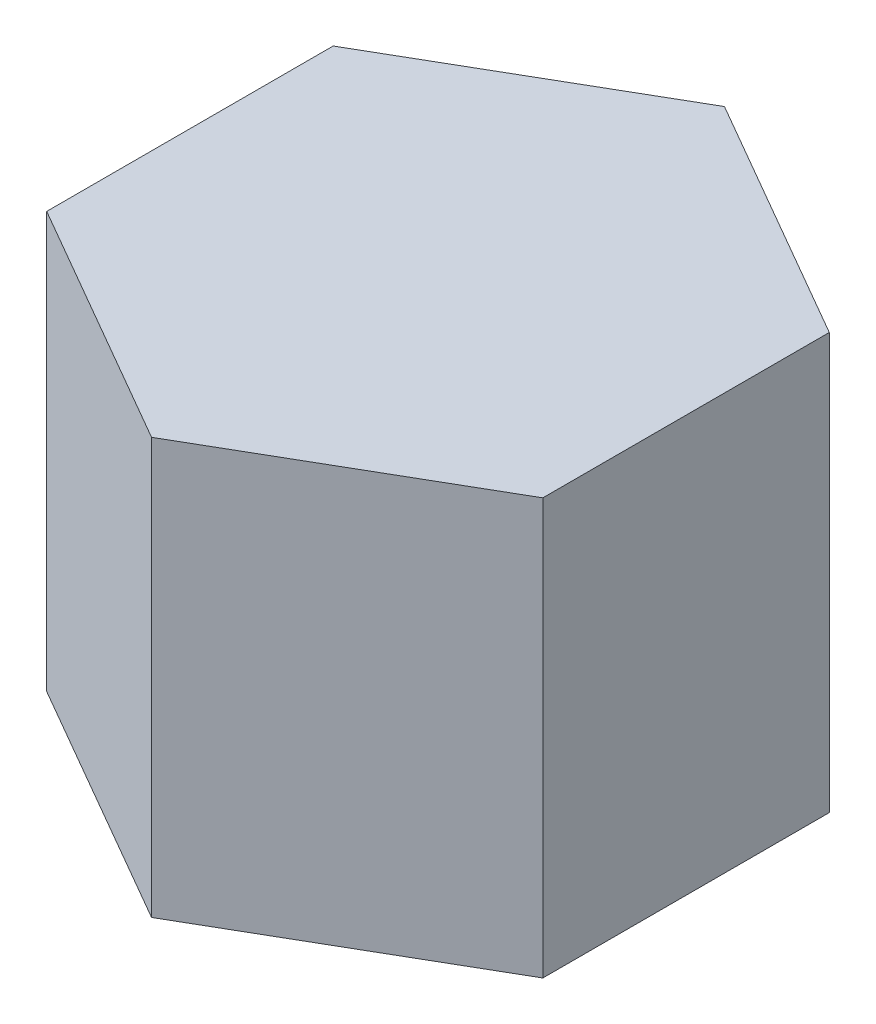
ISO-10303-21;
HEADER;
FILE_DESCRIPTION(('STEP AP214'),'2;1');
FILE_NAME('part.step','',(''),(''),'','','');
FILE_SCHEMA(('AUTOMOTIVE_DESIGN { 1 0 10303 214 1 1 1 1 }'));
ENDSEC;
DATA;
#1=APPLICATION_CONTEXT('core data for automotive mechanical design processes');
#2=APPLICATION_PROTOCOL_DEFINITION('international standard','automotive_design',2000,#1);
#3=PRODUCT_CONTEXT('',#1,'mechanical');
#4=PRODUCT('Part','Part','',(#3));
#5=PRODUCT_RELATED_PRODUCT_CATEGORY('part','',(#4));
#6=PRODUCT_DEFINITION_FORMATION('','',#4);
#7=PRODUCT_DEFINITION_CONTEXT('part definition',#1,'design');
#8=PRODUCT_DEFINITION('design','',#6,#7);
#9=PRODUCT_DEFINITION_SHAPE('','',#8);
#10=(LENGTH_UNIT() NAMED_UNIT(*) SI_UNIT(.MILLI.,.METRE.));
#11=(NAMED_UNIT(*) PLANE_ANGLE_UNIT() SI_UNIT($,.RADIAN.));
#12=(NAMED_UNIT(*) SI_UNIT($,.STERADIAN.) SOLID_ANGLE_UNIT());
#13=UNCERTAINTY_MEASURE_WITH_UNIT(LENGTH_MEASURE(1.E-05),#10,'distance_accuracy_value','');
#14=(GEOMETRIC_REPRESENTATION_CONTEXT(3) GLOBAL_UNCERTAINTY_ASSIGNED_CONTEXT((#13)) GLOBAL_UNIT_ASSIGNED_CONTEXT((#10,
#11,#12)) REPRESENTATION_CONTEXT('',''));
#15=CARTESIAN_POINT('',(0.,0.,0.));
#16=DIRECTION('',(0.,0.,1.));
#17=DIRECTION('',(1.,0.,0.));
#18=AXIS2_PLACEMENT_3D('',#15,#16,#17);
#19=CARTESIAN_POINT('',(207.642660308706,-148.537700895744,291.506971220494));
#20=DIRECTION('',(-0.499999999999909,0.,-0.866025403784491));
#21=DIRECTION('',(-0.866025403784491,0.,0.499999999999909));
#22=AXIS2_PLACEMENT_3D('',#19,#20,#21);
#23=PLANE('',#22);
#24=CARTESIAN_POINT('',(207.339551417382,-149.045793579175,291.681971220494));
#25=DIRECTION('',(0.866025403784491,0.,-0.499999999999909));
#26=VECTOR('',#25,1.);
#27=LINE('',#24,#26);
#28=CARTESIAN_POINT('',(207.339551417382,-149.045793579175,291.681971220494));
#29=VERTEX_POINT('',#28);
#30=CARTESIAN_POINT('',(207.642660308706,-149.045793579175,291.506971220494));
#31=VERTEX_POINT('',#30);
#32=EDGE_CURVE('E170',#29,#31,#27,.T.);
#33=ORIENTED_EDGE('',*,*,#32,.T.);
#34=CARTESIAN_POINT('',(207.642660308706,-148.537700895744,291.506971220494));
#35=DIRECTION('',(0.,-1.,0.));
#36=VECTOR('',#35,1.);
#37=LINE('',#34,#36);
#38=CARTESIAN_POINT('',(207.642660308706,-148.537700895744,291.506971220494));
#39=VERTEX_POINT('',#38);
#40=EDGE_CURVE('E35',#39,#31,#37,.T.);
#41=ORIENTED_EDGE('',*,*,#40,.F.);
#42=CARTESIAN_POINT('',(207.339551417382,-148.537700895744,291.681971220494));
#43=DIRECTION('',(0.866025403784491,0.,-0.499999999999909));
#44=VECTOR('',#43,1.);
#45=LINE('',#42,#44);
#46=CARTESIAN_POINT('',(207.339551417382,-148.537700895744,291.681971220494));
#47=VERTEX_POINT('',#46);
#48=EDGE_CURVE('E159',#47,#39,#45,.T.);
#49=ORIENTED_EDGE('',*,*,#48,.F.);
#50=CARTESIAN_POINT('',(207.339551417382,-148.537700895744,291.681971220494));
#51=DIRECTION('',(0.,-1.,0.));
#52=VECTOR('',#51,1.);
#53=LINE('',#50,#52);
#54=EDGE_CURVE('E10',#47,#29,#53,.T.);
#55=ORIENTED_EDGE('',*,*,#54,.T.);
#56=EDGE_LOOP('',(#33,#41,#49,#55));
#57=FACE_BOUND('',#56,.T.);
#58=ADVANCED_FACE('F16',(#57),#23,.F.);
#59=CARTESIAN_POINT('',(207.339551417382,-148.537700895744,291.681971220494));
#60=DIRECTION('',(0.500000000000062,0.,-0.866025403784403));
#61=DIRECTION('',(-0.866025403784403,0.,-0.500000000000062));
#62=AXIS2_PLACEMENT_3D('',#59,#60,#61);
#63=PLANE('',#62);
#64=CARTESIAN_POINT('',(207.036442526057,-149.045793579175,291.506971220494));
#65=DIRECTION('',(0.866025403784403,0.,0.500000000000062));
#66=VECTOR('',#65,1.);
#67=LINE('',#64,#66);
#68=CARTESIAN_POINT('',(207.036442526057,-149.045793579175,291.506971220494));
#69=VERTEX_POINT('',#68);
#70=EDGE_CURVE('E167',#69,#29,#67,.T.);
#71=ORIENTED_EDGE('',*,*,#70,.T.);
#72=ORIENTED_EDGE('',*,*,#54,.F.);
#73=CARTESIAN_POINT('',(207.036442526057,-148.537700895744,291.506971220494));
#74=DIRECTION('',(0.866025403784403,0.,0.500000000000062));
#75=VECTOR('',#74,1.);
#76=LINE('',#73,#75);
#77=CARTESIAN_POINT('',(207.036442526057,-148.537700895744,291.506971220494));
#78=VERTEX_POINT('',#77);
#79=EDGE_CURVE('E156',#78,#47,#76,.T.);
#80=ORIENTED_EDGE('',*,*,#79,.F.);
#81=CARTESIAN_POINT('',(207.036442526057,-148.537700895744,291.506971220494));
#82=DIRECTION('',(0.,-1.,0.));
#83=VECTOR('',#82,1.);
#84=LINE('',#81,#83);
#85=EDGE_CURVE('E27',#78,#69,#84,.T.);
#86=ORIENTED_EDGE('',*,*,#85,.T.);
#87=EDGE_LOOP('',(#71,#72,#80,#86));
#88=FACE_BOUND('',#87,.T.);
#89=ADVANCED_FACE('F189',(#88),#63,.F.);
#90=CARTESIAN_POINT('',(207.036442526057,-148.537700895744,290.831971220494));
#91=DIRECTION('',(1.,0.,0.));
#92=DIRECTION('',(0.,1.,0.));
#93=AXIS2_PLACEMENT_3D('',#90,#91,#92);
#94=PLANE('',#93);
#95=CARTESIAN_POINT('',(207.036442526057,-149.045793579175,291.156971220494));
#96=DIRECTION('',(0.,0.,1.));
#97=VECTOR('',#96,1.);
#98=LINE('',#95,#97);
#99=CARTESIAN_POINT('',(207.036442526057,-149.045793579175,291.156971220494));
#100=VERTEX_POINT('',#99);
#101=EDGE_CURVE('E163',#100,#69,#98,.T.);
#102=ORIENTED_EDGE('',*,*,#101,.T.);
#103=ORIENTED_EDGE('',*,*,#85,.F.);
#104=CARTESIAN_POINT('',(207.036442526057,-148.537700895744,291.156971220494));
#105=DIRECTION('',(0.,0.,1.));
#106=VECTOR('',#105,1.);
#107=LINE('',#104,#106);
#108=CARTESIAN_POINT('',(207.036442526057,-148.537700895744,291.156971220494));
#109=VERTEX_POINT('',#108);
#110=EDGE_CURVE('E106',#109,#78,#107,.T.);
#111=ORIENTED_EDGE('',*,*,#110,.F.);
#112=CARTESIAN_POINT('',(207.036442526057,-148.537700895744,291.156971220494));
#113=DIRECTION('',(0.,-1.,0.));
#114=VECTOR('',#113,1.);
#115=LINE('',#112,#114);
#116=EDGE_CURVE('E94',#109,#100,#115,.T.);
#117=ORIENTED_EDGE('',*,*,#116,.T.);
#118=EDGE_LOOP('',(#102,#103,#111,#117));
#119=FACE_BOUND('',#118,.T.);
#120=ADVANCED_FACE('F198',(#119),#94,.F.);
#121=CARTESIAN_POINT('',(207.036442526057,-148.537700895744,291.156971220494));
#122=DIRECTION('',(0.499999999999943,0.,0.866025403784472));
#123=DIRECTION('',(0.866025403784472,0.,-0.499999999999943));
#124=AXIS2_PLACEMENT_3D('',#121,#122,#123);
#125=PLANE('',#124);
#126=CARTESIAN_POINT('',(207.339551417382,-149.045793579175,290.981971220494));
#127=DIRECTION('',(-0.866025403784471,0.,0.499999999999943));
#128=VECTOR('',#127,1.);
#129=LINE('',#126,#128);
#130=CARTESIAN_POINT('',(207.339551417382,-149.045793579175,290.981971220494));
#131=VERTEX_POINT('',#130);
#132=EDGE_CURVE('E162',#131,#100,#129,.T.);
#133=ORIENTED_EDGE('',*,*,#132,.T.);
#134=ORIENTED_EDGE('',*,*,#116,.F.);
#135=CARTESIAN_POINT('',(207.339551417382,-148.537700895744,290.981971220494));
#136=DIRECTION('',(-0.866025403784471,0.,0.499999999999943));
#137=VECTOR('',#136,1.);
#138=LINE('',#135,#137);
#139=CARTESIAN_POINT('',(207.339551417382,-148.537700895744,290.981971220494));
#140=VERTEX_POINT('',#139);
#141=EDGE_CURVE('E98',#140,#109,#138,.T.);
#142=ORIENTED_EDGE('',*,*,#141,.F.);
#143=CARTESIAN_POINT('',(207.339551417382,-148.537700895744,290.981971220494));
#144=DIRECTION('',(0.,-1.,0.));
#145=VECTOR('',#144,1.);
#146=LINE('',#143,#145);
#147=EDGE_CURVE('E79',#140,#131,#146,.T.);
#148=ORIENTED_EDGE('',*,*,#147,.T.);
#149=EDGE_LOOP('',(#133,#134,#142,#148));
#150=FACE_BOUND('',#149,.T.);
#151=ADVANCED_FACE('F100',(#150),#125,.F.);
#152=CARTESIAN_POINT('',(207.339551417382,-148.537700895744,290.981971220494));
#153=DIRECTION('',(-0.500000000000062,0.,0.866025403784403));
#154=DIRECTION('',(0.866025403784403,0.,0.500000000000062));
#155=AXIS2_PLACEMENT_3D('',#152,#153,#154);
#156=PLANE('',#155);
#157=CARTESIAN_POINT('',(207.642660308706,-149.045793579175,291.156971220494));
#158=DIRECTION('',(-0.866025403784403,0.,-0.500000000000062));
#159=VECTOR('',#158,1.);
#160=LINE('',#157,#159);
#161=CARTESIAN_POINT('',(207.642660308706,-149.045793579175,291.156971220494));
#162=VERTEX_POINT('',#161);
#163=EDGE_CURVE('E88',#162,#131,#160,.T.);
#164=ORIENTED_EDGE('',*,*,#163,.T.);
#165=ORIENTED_EDGE('',*,*,#147,.F.);
#166=CARTESIAN_POINT('',(207.642660308706,-148.537700895744,291.156971220494));
#167=DIRECTION('',(-0.866025403784403,0.,-0.500000000000062));
#168=VECTOR('',#167,1.);
#169=LINE('',#166,#168);
#170=CARTESIAN_POINT('',(207.642660308706,-148.537700895744,291.156971220494));
#171=VERTEX_POINT('',#170);
#172=EDGE_CURVE('E84',#171,#140,#169,.T.);
#173=ORIENTED_EDGE('',*,*,#172,.F.);
#174=CARTESIAN_POINT('',(207.642660308706,-148.537700895744,291.156971220494));
#175=DIRECTION('',(0.,-1.,0.));
#176=VECTOR('',#175,1.);
#177=LINE('',#174,#176);
#178=EDGE_CURVE('E58',#171,#162,#177,.T.);
#179=ORIENTED_EDGE('',*,*,#178,.T.);
#180=EDGE_LOOP('',(#164,#165,#173,#179));
#181=FACE_BOUND('',#180,.T.);
#182=ADVANCED_FACE('F82',(#181),#156,.F.);
#183=CARTESIAN_POINT('',(207.642660308706,-148.537700895744,290.831971220494));
#184=DIRECTION('',(-1.,0.,0.));
#185=DIRECTION('',(0.,-1.,0.));
#186=AXIS2_PLACEMENT_3D('',#183,#184,#185);
#187=PLANE('',#186);
#188=CARTESIAN_POINT('',(207.642660308706,-149.045793579175,291.506971220494));
#189=DIRECTION('',(0.,0.,-1.));
#190=VECTOR('',#189,1.);
#191=LINE('',#188,#190);
#192=EDGE_CURVE('E160',#31,#162,#191,.T.);
#193=ORIENTED_EDGE('',*,*,#192,.T.);
#194=ORIENTED_EDGE('',*,*,#178,.F.);
#195=CARTESIAN_POINT('',(207.642660308706,-148.537700895744,291.506971220494));
#196=DIRECTION('',(0.,0.,-1.));
#197=VECTOR('',#196,1.);
#198=LINE('',#195,#197);
#199=EDGE_CURVE('E112',#39,#171,#198,.T.);
#200=ORIENTED_EDGE('',*,*,#199,.F.);
#201=ORIENTED_EDGE('',*,*,#40,.T.);
#202=EDGE_LOOP('',(#193,#194,#200,#201));
#203=FACE_BOUND('',#202,.T.);
#204=ADVANCED_FACE('F131',(#203),#187,.F.);
#205=CARTESIAN_POINT('',(206.339551417382,-148.537700895744,290.831971220494));
#206=DIRECTION('',(0.,-1.,0.));
#207=DIRECTION('',(1.,0.,0.));
#208=AXIS2_PLACEMENT_3D('',#205,#206,#207);
#209=PLANE('',#208);
#210=ORIENTED_EDGE('',*,*,#48,.T.);
#211=ORIENTED_EDGE('',*,*,#199,.T.);
#212=ORIENTED_EDGE('',*,*,#172,.T.);
#213=ORIENTED_EDGE('',*,*,#141,.T.);
#214=ORIENTED_EDGE('',*,*,#110,.T.);
#215=ORIENTED_EDGE('',*,*,#79,.T.);
#216=EDGE_LOOP('',(#210,#211,#212,#213,#214,#215));
#217=FACE_BOUND('',#216,.T.);
#218=ADVANCED_FACE('F111',(#217),#209,.F.);
#219=CARTESIAN_POINT('',(206.339551417382,-149.045793579175,290.831971220494));
#220=DIRECTION('',(0.,-1.,0.));
#221=DIRECTION('',(1.,0.,0.));
#222=AXIS2_PLACEMENT_3D('',#219,#220,#221);
#223=PLANE('',#222);
#224=ORIENTED_EDGE('',*,*,#32,.F.);
#225=ORIENTED_EDGE('',*,*,#70,.F.);
#226=ORIENTED_EDGE('',*,*,#101,.F.);
#227=ORIENTED_EDGE('',*,*,#132,.F.);
#228=ORIENTED_EDGE('',*,*,#163,.F.);
#229=ORIENTED_EDGE('',*,*,#192,.F.);
#230=EDGE_LOOP('',(#224,#225,#226,#227,#228,#229));
#231=FACE_BOUND('',#230,.T.);
#232=ADVANCED_FACE('F130',(#231),#223,.T.);
#233=CLOSED_SHELL('',(#58,#89,#120,#151,#182,#204,#218,#232));
#234=MANIFOLD_SOLID_BREP('B1',#233);
#235=ADVANCED_BREP_SHAPE_REPRESENTATION('',(#18,#234),#14);
#236=SHAPE_DEFINITION_REPRESENTATION(#9,#235);
ENDSEC;
END-ISO-10303-21;
